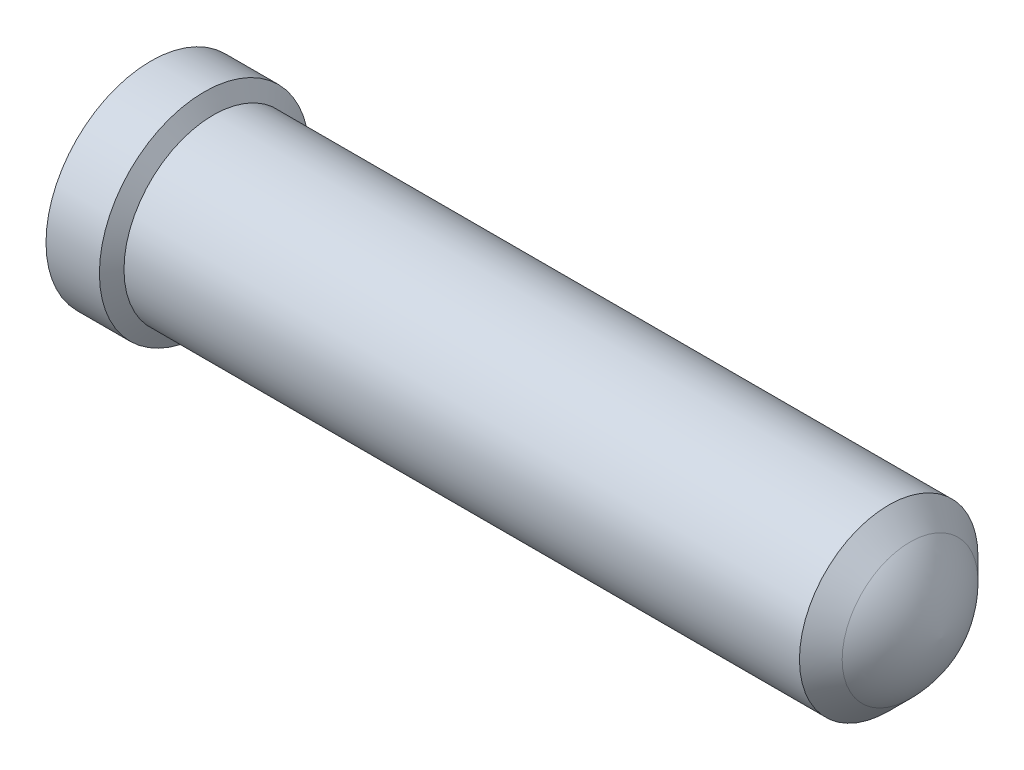
ISO-10303-21;
HEADER;
FILE_DESCRIPTION(('STEP AP214'),'2;1');
FILE_NAME('part.step','',(''),(''),'','','');
FILE_SCHEMA(('AUTOMOTIVE_DESIGN { 1 0 10303 214 1 1 1 1 }'));
ENDSEC;
DATA;
#1=APPLICATION_CONTEXT('core data for automotive mechanical design processes');
#2=APPLICATION_PROTOCOL_DEFINITION('international standard','automotive_design',2000,#1);
#3=PRODUCT_CONTEXT('',#1,'mechanical');
#4=PRODUCT('Part','Part','',(#3));
#5=PRODUCT_RELATED_PRODUCT_CATEGORY('part','',(#4));
#6=PRODUCT_DEFINITION_FORMATION('','',#4);
#7=PRODUCT_DEFINITION_CONTEXT('part definition',#1,'design');
#8=PRODUCT_DEFINITION('design','',#6,#7);
#9=PRODUCT_DEFINITION_SHAPE('','',#8);
#10=(LENGTH_UNIT() NAMED_UNIT(*) SI_UNIT(.MILLI.,.METRE.));
#11=(NAMED_UNIT(*) PLANE_ANGLE_UNIT() SI_UNIT($,.RADIAN.));
#12=(NAMED_UNIT(*) SI_UNIT($,.STERADIAN.) SOLID_ANGLE_UNIT());
#13=UNCERTAINTY_MEASURE_WITH_UNIT(LENGTH_MEASURE(1.E-05),#10,'distance_accuracy_value','');
#14=(GEOMETRIC_REPRESENTATION_CONTEXT(3) GLOBAL_UNCERTAINTY_ASSIGNED_CONTEXT((#13)) GLOBAL_UNIT_ASSIGNED_CONTEXT((#10,
#11,#12)) REPRESENTATION_CONTEXT('',''));
#15=CARTESIAN_POINT('',(0.,0.,0.));
#16=DIRECTION('',(0.,0.,1.));
#17=DIRECTION('',(1.,0.,0.));
#18=AXIS2_PLACEMENT_3D('',#15,#16,#17);
#19=CARTESIAN_POINT('',(4.06560736971015,0.,-0.0451528060534945));
#20=DIRECTION('',(0.,-1.,0.));
#21=DIRECTION('',(0.,0.,1.));
#22=AXIS2_PLACEMENT_3D('',#19,#20,#21);
#23=CIRCLE('',#22,0.635000000000001);
#24=TRIMMED_CURVE('',#23,(PARAMETER_VALUE(-1.49962948747843)),
(PARAMETER_VALUE(1.49962948747843)),.T.,.PARAMETER.);
#25=CARTESIAN_POINT('',(4.06560736971015,0.,0.));
#26=DIRECTION('',(-1.,0.,0.));
#27=AXIS1_PLACEMENT('',#25,#26);
#28=SURFACE_OF_REVOLUTION('',#24,#27);
#29=CARTESIAN_POINT('',(4.51462017576365,0.,0.));
#30=DIRECTION('',(-1.,0.,0.));
#31=DIRECTION('',(0.,0.,1.));
#32=AXIS2_PLACEMENT_3D('',#29,#30,#31);
#33=CIRCLE('',#32,0.40385999999995);
#34=CARTESIAN_POINT('',(4.51462017576365,0.,0.40385999999995));
#35=VERTEX_POINT('',#34);
#36=EDGE_CURVE('E11',#35,#35,#33,.T.);
#37=ORIENTED_EDGE('',*,*,#36,.F.);
#38=EDGE_LOOP('',(#37));
#39=FACE_BOUND('',#38,.T.);
#40=CARTESIAN_POINT('',(4.699,0.,0.));
#41=VERTEX_POINT('',#40);
#42=VERTEX_LOOP('',#41);
#43=FACE_BOUND('',#42,.T.);
#44=ADVANCED_FACE('F33',(#39,#43),#28,.T.);
#45=CARTESIAN_POINT('',(4.51462017576365,0.,0.));
#46=DIRECTION('',(-1.,0.,0.));
#47=DIRECTION('',(0.,0.,1.));
#48=AXIS2_PLACEMENT_3D('',#45,#46,#47);
#49=CONICAL_SURFACE('',#48,0.40385999999995,0.785398163397503);
#50=CARTESIAN_POINT('',(4.38762017576365,0.,0.));
#51=DIRECTION('',(-1.,0.,0.));
#52=DIRECTION('',(0.,0.,1.));
#53=AXIS2_PLACEMENT_3D('',#50,#51,#52);
#54=CIRCLE('',#53,0.530859999999966);
#55=CARTESIAN_POINT('',(4.38762017576365,0.,0.530859999999966));
#56=VERTEX_POINT('',#55);
#57=EDGE_CURVE('E40',#56,#56,#54,.T.);
#58=ORIENTED_EDGE('',*,*,#57,.F.);
#59=EDGE_LOOP('',(#58));
#60=FACE_BOUND('',#59,.T.);
#61=ORIENTED_EDGE('',*,*,#36,.T.);
#62=EDGE_LOOP('',(#61));
#63=FACE_BOUND('',#62,.T.);
#64=ADVANCED_FACE('F76',(#60,#63),#49,.T.);
#65=CARTESIAN_POINT('',(0.,0.,0.));
#66=DIRECTION('',(-1.,0.,0.));
#67=DIRECTION('',(0.,0.,1.));
#68=AXIS2_PLACEMENT_3D('',#65,#66,#67);
#69=CYLINDRICAL_SURFACE('',#68,0.530859999999961);
#70=CARTESIAN_POINT('',(0.371026143456665,0.,0.));
#71=DIRECTION('',(-1.,0.,0.));
#72=DIRECTION('',(0.,0.,1.));
#73=AXIS2_PLACEMENT_3D('',#70,#71,#72);
#74=CIRCLE('',#73,0.530859999999955);
#75=CARTESIAN_POINT('',(0.371026143456665,0.,0.530859999999955));
#76=VERTEX_POINT('',#75);
#77=EDGE_CURVE('E69',#76,#76,#74,.T.);
#78=ORIENTED_EDGE('',*,*,#77,.F.);
#79=EDGE_LOOP('',(#78));
#80=FACE_BOUND('',#79,.T.);
#81=ORIENTED_EDGE('',*,*,#57,.T.);
#82=EDGE_LOOP('',(#81));
#83=FACE_BOUND('',#82,.T.);
#84=ADVANCED_FACE('F74',(#80,#83),#69,.T.);
#85=CARTESIAN_POINT('',(0.371026143456665,0.,0.));
#86=DIRECTION('',(-1.,0.,0.));
#87=DIRECTION('',(0.,0.,1.));
#88=AXIS2_PLACEMENT_3D('',#85,#86,#87);
#89=CONICAL_SURFACE('',#88,0.530859999999955,1.0471975511962);
#90=CARTESIAN_POINT('',(0.317500000000026,0.,0.));
#91=DIRECTION('',(-1.,0.,0.));
#92=DIRECTION('',(0.,0.,1.));
#93=AXIS2_PLACEMENT_3D('',#90,#91,#92);
#94=CIRCLE('',#93,0.62356999999999);
#95=CARTESIAN_POINT('',(0.317500000000026,0.,0.62356999999999));
#96=VERTEX_POINT('',#95);
#97=EDGE_CURVE('E60',#96,#96,#94,.T.);
#98=ORIENTED_EDGE('',*,*,#97,.F.);
#99=EDGE_LOOP('',(#98));
#100=FACE_BOUND('',#99,.T.);
#101=ORIENTED_EDGE('',*,*,#77,.T.);
#102=EDGE_LOOP('',(#101));
#103=FACE_BOUND('',#102,.T.);
#104=ADVANCED_FACE('F94',(#100,#103),#89,.T.);
#105=CARTESIAN_POINT('',(0.,0.,0.));
#106=DIRECTION('',(-1.,0.,0.));
#107=DIRECTION('',(0.,0.,1.));
#108=AXIS2_PLACEMENT_3D('',#105,#106,#107);
#109=CYLINDRICAL_SURFACE('',#108,0.62356999999999);
#110=CARTESIAN_POINT('',(0.,0.,0.));
#111=DIRECTION('',(-1.,0.,0.));
#112=DIRECTION('',(0.,0.,1.));
#113=AXIS2_PLACEMENT_3D('',#110,#111,#112);
#114=CIRCLE('',#113,0.62356999999999);
#115=CARTESIAN_POINT('',(0.,0.,0.62356999999999));
#116=VERTEX_POINT('',#115);
#117=EDGE_CURVE('E56',#116,#116,#114,.T.);
#118=ORIENTED_EDGE('',*,*,#117,.F.);
#119=EDGE_LOOP('',(#118));
#120=FACE_BOUND('',#119,.T.);
#121=ORIENTED_EDGE('',*,*,#97,.T.);
#122=EDGE_LOOP('',(#121));
#123=FACE_BOUND('',#122,.T.);
#124=ADVANCED_FACE('F102',(#120,#123),#109,.T.);
#125=CARTESIAN_POINT('',(0.,0.,0.));
#126=DIRECTION('',(1.,0.,0.));
#127=DIRECTION('',(0.,0.,-1.));
#128=AXIS2_PLACEMENT_3D('',#125,#126,#127);
#129=PLANE('',#128);
#130=CARTESIAN_POINT('',(0.,0.,0.));
#131=DIRECTION('',(-1.,0.,0.));
#132=DIRECTION('',(0.,0.,1.));
#133=AXIS2_PLACEMENT_3D('',#130,#131,#132);
#134=CIRCLE('',#133,0.546100000000001);
#135=CARTESIAN_POINT('',(0.,0.,0.546100000000001));
#136=VERTEX_POINT('',#135);
#137=EDGE_CURVE('E63',#136,#136,#134,.T.);
#138=ORIENTED_EDGE('',*,*,#137,.F.);
#139=EDGE_LOOP('',(#138));
#140=FACE_BOUND('',#139,.T.);
#141=ORIENTED_EDGE('',*,*,#117,.T.);
#142=EDGE_LOOP('',(#141));
#143=FACE_BOUND('',#142,.T.);
#144=ADVANCED_FACE('F50',(#140,#143),#129,.F.);
#145=CARTESIAN_POINT('',(2.54,0.,0.));
#146=DIRECTION('',(-1.,0.,0.));
#147=DIRECTION('',(0.,0.,1.));
#148=AXIS2_PLACEMENT_3D('',#145,#146,#147);
#149=CONICAL_SURFACE('',#148,0.457200000000001,1.02974425867666);
#150=CARTESIAN_POINT('',(2.8147134750194,0.,0.));
#151=VERTEX_POINT('',#150);
#152=VERTEX_LOOP('',#151);
#153=FACE_BOUND('',#152,.T.);
#154=CARTESIAN_POINT('',(2.54,0.,0.));
#155=DIRECTION('',(-1.,0.,0.));
#156=DIRECTION('',(0.,0.,1.));
#157=AXIS2_PLACEMENT_3D('',#154,#155,#156);
#158=CIRCLE('',#157,0.457200000000001);
#159=CARTESIAN_POINT('',(2.54,0.,0.457200000000001));
#160=VERTEX_POINT('',#159);
#161=EDGE_CURVE('E54',#160,#160,#158,.T.);
#162=ORIENTED_EDGE('',*,*,#161,.T.);
#163=EDGE_LOOP('',(#162));
#164=FACE_BOUND('',#163,.T.);
#165=ADVANCED_FACE('F46',(#153,#164),#149,.F.);
#166=CARTESIAN_POINT('',(0.,0.,0.));
#167=DIRECTION('',(-1.,0.,0.));
#168=DIRECTION('',(0.,0.,1.));
#169=AXIS2_PLACEMENT_3D('',#166,#167,#168);
#170=CYLINDRICAL_SURFACE('',#169,0.457200000000001);
#171=ORIENTED_EDGE('',*,*,#161,.F.);
#172=EDGE_LOOP('',(#171));
#173=FACE_BOUND('',#172,.T.);
#174=CARTESIAN_POINT('',(0.0888999999999977,0.,0.));
#175=DIRECTION('',(-1.,0.,0.));
#176=DIRECTION('',(0.,0.,1.));
#177=AXIS2_PLACEMENT_3D('',#174,#175,#176);
#178=CIRCLE('',#177,0.457200000000001);
#179=CARTESIAN_POINT('',(0.0888999999999977,0.,0.457200000000001));
#180=VERTEX_POINT('',#179);
#181=EDGE_CURVE('E57',#180,#180,#178,.T.);
#182=ORIENTED_EDGE('',*,*,#181,.T.);
#183=EDGE_LOOP('',(#182));
#184=FACE_BOUND('',#183,.T.);
#185=ADVANCED_FACE('F49',(#173,#184),#170,.F.);
#186=CARTESIAN_POINT('',(0.,0.,0.));
#187=DIRECTION('',(-1.,0.,0.));
#188=DIRECTION('',(0.,0.,1.));
#189=AXIS2_PLACEMENT_3D('',#186,#187,#188);
#190=CONICAL_SURFACE('',#189,0.546100000000001,0.785398163397448);
#191=ORIENTED_EDGE('',*,*,#181,.F.);
#192=EDGE_LOOP('',(#191));
#193=FACE_BOUND('',#192,.T.);
#194=ORIENTED_EDGE('',*,*,#137,.T.);
#195=EDGE_LOOP('',(#194));
#196=FACE_BOUND('',#195,.T.);
#197=ADVANCED_FACE('F128',(#193,#196),#190,.F.);
#198=CLOSED_SHELL('',(#44,#64,#84,#104,#124,#144,#165,#185,#197));
#199=MANIFOLD_SOLID_BREP('B2',#198);
#200=ADVANCED_BREP_SHAPE_REPRESENTATION('',(#18,#199),#14);
#201=SHAPE_DEFINITION_REPRESENTATION(#9,#200);
ENDSEC;
END-ISO-10303-21;
